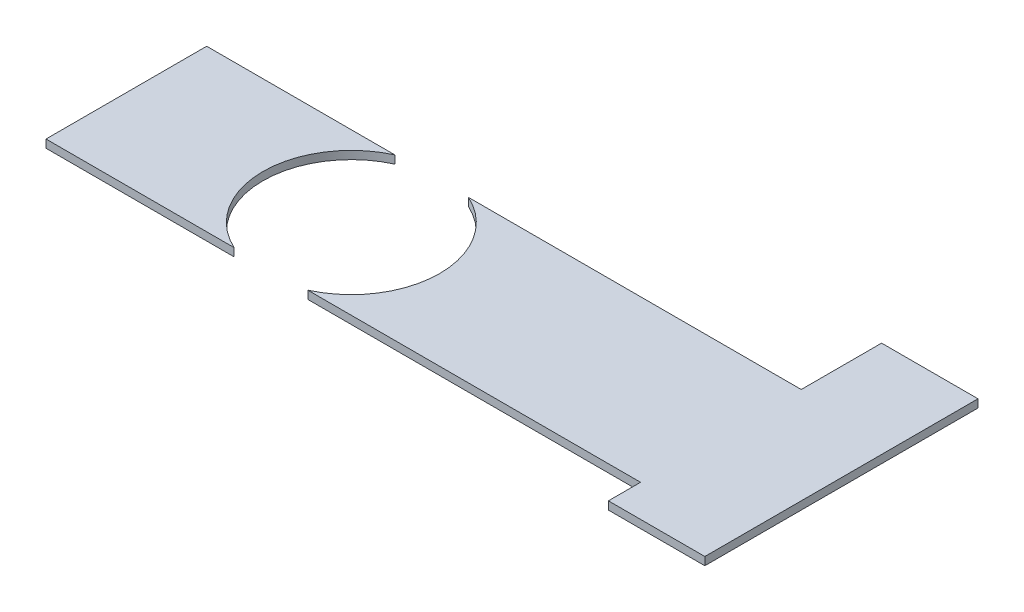
ISO-10303-21;
HEADER;
FILE_DESCRIPTION(('STEP AP214'),'2;1');
FILE_NAME('part.step','',(''),(''),'','','');
FILE_SCHEMA(('AUTOMOTIVE_DESIGN { 1 0 10303 214 1 1 1 1 }'));
ENDSEC;
DATA;
#1=APPLICATION_CONTEXT('core data for automotive mechanical design processes');
#2=APPLICATION_PROTOCOL_DEFINITION('international standard','automotive_design',2000,#1);
#3=PRODUCT_CONTEXT('',#1,'mechanical');
#4=PRODUCT('Part','Part','',(#3));
#5=PRODUCT_RELATED_PRODUCT_CATEGORY('part','',(#4));
#6=PRODUCT_DEFINITION_FORMATION('','',#4);
#7=PRODUCT_DEFINITION_CONTEXT('part definition',#1,'design');
#8=PRODUCT_DEFINITION('design','',#6,#7);
#9=PRODUCT_DEFINITION_SHAPE('','',#8);
#10=(LENGTH_UNIT() NAMED_UNIT(*) SI_UNIT(.MILLI.,.METRE.));
#11=(NAMED_UNIT(*) PLANE_ANGLE_UNIT() SI_UNIT($,.RADIAN.));
#12=(NAMED_UNIT(*) SI_UNIT($,.STERADIAN.) SOLID_ANGLE_UNIT());
#13=UNCERTAINTY_MEASURE_WITH_UNIT(LENGTH_MEASURE(1.E-05),#10,'distance_accuracy_value','');
#14=(GEOMETRIC_REPRESENTATION_CONTEXT(3) GLOBAL_UNCERTAINTY_ASSIGNED_CONTEXT((#13)) GLOBAL_UNIT_ASSIGNED_CONTEXT((#10,
#11,#12)) REPRESENTATION_CONTEXT('',''));
#15=CARTESIAN_POINT('',(0.,0.,0.));
#16=DIRECTION('',(0.,0.,1.));
#17=DIRECTION('',(1.,0.,0.));
#18=AXIS2_PLACEMENT_3D('',#15,#16,#17);
#19=CARTESIAN_POINT('',(25.6779661016949,0.5,5.));
#20=DIRECTION('',(0.,0.,-1.));
#21=DIRECTION('',(-1.,0.,0.));
#22=AXIS2_PLACEMENT_3D('',#19,#20,#21);
#23=PLANE('',#22);
#24=DIRECTION('',(1.,0.,0.));
#25=VECTOR('',#24,1.);
#26=CARTESIAN_POINT('',(25.6779661016949,0.5,5.));
#27=LINE('',#26,#25);
#28=CARTESIAN_POINT('',(4.96925394917282,0.5,5.));
#29=VERTEX_POINT('',#28);
#30=CARTESIAN_POINT('',(25.6779661016949,0.5,5.));
#31=VERTEX_POINT('',#30);
#32=EDGE_CURVE('E116',#29,#31,#27,.T.);
#33=ORIENTED_EDGE('',*,*,#32,.F.);
#34=DIRECTION('',(0.,-1.,0.));
#35=VECTOR('',#34,1.);
#36=CARTESIAN_POINT('',(4.96925394917282,0.5,5.));
#37=LINE('',#36,#35);
#38=CARTESIAN_POINT('',(4.96925394917282,0.,5.));
#39=VERTEX_POINT('',#38);
#40=EDGE_CURVE('E67',#29,#39,#37,.T.);
#41=ORIENTED_EDGE('',*,*,#40,.T.);
#42=DIRECTION('',(1.,0.,0.));
#43=VECTOR('',#42,1.);
#44=CARTESIAN_POINT('',(25.6779661016949,0.,5.));
#45=LINE('',#44,#43);
#46=CARTESIAN_POINT('',(25.6779661016949,0.,5.));
#47=VERTEX_POINT('',#46);
#48=EDGE_CURVE('E132',#39,#47,#45,.T.);
#49=ORIENTED_EDGE('',*,*,#48,.T.);
#50=DIRECTION('',(0.,-1.,0.));
#51=VECTOR('',#50,1.);
#52=CARTESIAN_POINT('',(25.6779661016949,0.5,5.));
#53=LINE('',#52,#51);
#54=EDGE_CURVE('E167',#31,#47,#53,.T.);
#55=ORIENTED_EDGE('',*,*,#54,.F.);
#56=EDGE_LOOP('',(#33,#41,#49,#55));
#57=FACE_BOUND('',#56,.T.);
#58=ADVANCED_FACE('F49',(#57),#23,.F.);
#59=CARTESIAN_POINT('',(0.,0.5,0.));
#60=DIRECTION('',(0.,-1.,0.));
#61=DIRECTION('',(0.,0.,-1.));
#62=AXIS2_PLACEMENT_3D('',#59,#60,#61);
#63=PLANE('',#62);
#64=DIRECTION('',(-1.,0.,0.));
#65=VECTOR('',#64,1.);
#66=CARTESIAN_POINT('',(-11.3220338983051,0.5,-5.));
#67=LINE('',#66,#65);
#68=CARTESIAN_POINT('',(25.6779661016949,0.5,-5.));
#69=VERTEX_POINT('',#68);
#70=CARTESIAN_POINT('',(4.96925394917283,0.5,-5.));
#71=VERTEX_POINT('',#70);
#72=EDGE_CURVE('E117',#69,#71,#67,.T.);
#73=ORIENTED_EDGE('',*,*,#72,.T.);
#74=CARTESIAN_POINT('',(2.6779661016949,0.5,0.));
#75=DIRECTION('',(0.,-1.,0.));
#76=DIRECTION('',(0.,0.,-1.));
#77=AXIS2_PLACEMENT_3D('',#74,#75,#76);
#78=CIRCLE('',#77,5.5);
#79=EDGE_CURVE('E53',#71,#29,#78,.T.);
#80=ORIENTED_EDGE('',*,*,#79,.T.);
#81=ORIENTED_EDGE('',*,*,#32,.T.);
#82=DIRECTION('',(0.,0.,1.));
#83=VECTOR('',#82,1.);
#84=CARTESIAN_POINT('',(25.6779661016949,0.5,7.));
#85=LINE('',#84,#83);
#86=CARTESIAN_POINT('',(25.6779661016949,0.5,7.));
#87=VERTEX_POINT('',#86);
#88=EDGE_CURVE('E138',#31,#87,#85,.T.);
#89=ORIENTED_EDGE('',*,*,#88,.T.);
#90=DIRECTION('',(1.,0.,0.));
#91=VECTOR('',#90,1.);
#92=CARTESIAN_POINT('',(31.6779661016949,0.5,7.));
#93=LINE('',#92,#91);
#94=CARTESIAN_POINT('',(31.6779661016949,0.5,7.));
#95=VERTEX_POINT('',#94);
#96=EDGE_CURVE('E179',#87,#95,#93,.T.);
#97=ORIENTED_EDGE('',*,*,#96,.T.);
#98=DIRECTION('',(0.,0.,-1.));
#99=VECTOR('',#98,1.);
#100=CARTESIAN_POINT('',(31.6779661016949,0.5,-10.));
#101=LINE('',#100,#99);
#102=CARTESIAN_POINT('',(31.6779661016949,0.5,-10.));
#103=VERTEX_POINT('',#102);
#104=EDGE_CURVE('E176',#95,#103,#101,.T.);
#105=ORIENTED_EDGE('',*,*,#104,.T.);
#106=DIRECTION('',(-1.,0.,0.));
#107=VECTOR('',#106,1.);
#108=CARTESIAN_POINT('',(25.6779661016949,0.5,-10.));
#109=LINE('',#108,#107);
#110=CARTESIAN_POINT('',(25.6779661016949,0.5,-10.));
#111=VERTEX_POINT('',#110);
#112=EDGE_CURVE('E173',#103,#111,#109,.T.);
#113=ORIENTED_EDGE('',*,*,#112,.T.);
#114=DIRECTION('',(0.,0.,1.));
#115=VECTOR('',#114,1.);
#116=CARTESIAN_POINT('',(25.6779661016949,0.5,-5.));
#117=LINE('',#116,#115);
#118=EDGE_CURVE('E129',#111,#69,#117,.T.);
#119=ORIENTED_EDGE('',*,*,#118,.T.);
#120=EDGE_LOOP('',(#73,#80,#81,#89,#97,#105,#113,#119));
#121=FACE_BOUND('',#120,.T.);
#122=ADVANCED_FACE('F127',(#121),#63,.F.);
#123=CARTESIAN_POINT('',(0.,0.,0.));
#124=DIRECTION('',(0.,-1.,0.));
#125=DIRECTION('',(0.,0.,-1.));
#126=AXIS2_PLACEMENT_3D('',#123,#124,#125);
#127=PLANE('',#126);
#128=CARTESIAN_POINT('',(2.6779661016949,0.,0.));
#129=DIRECTION('',(0.,-1.,0.));
#130=DIRECTION('',(0.,0.,-1.));
#131=AXIS2_PLACEMENT_3D('',#128,#129,#130);
#132=CIRCLE('',#131,5.5);
#133=CARTESIAN_POINT('',(4.96925394917283,0.,-5.));
#134=VERTEX_POINT('',#133);
#135=EDGE_CURVE('E12',#134,#39,#132,.T.);
#136=ORIENTED_EDGE('',*,*,#135,.F.);
#137=DIRECTION('',(-1.,0.,0.));
#138=VECTOR('',#137,1.);
#139=CARTESIAN_POINT('',(-11.3220338983051,0.,-5.));
#140=LINE('',#139,#138);
#141=CARTESIAN_POINT('',(25.6779661016949,0.,-5.));
#142=VERTEX_POINT('',#141);
#143=EDGE_CURVE('E124',#142,#134,#140,.T.);
#144=ORIENTED_EDGE('',*,*,#143,.F.);
#145=DIRECTION('',(0.,0.,1.));
#146=VECTOR('',#145,1.);
#147=CARTESIAN_POINT('',(25.6779661016949,0.,-5.));
#148=LINE('',#147,#146);
#149=CARTESIAN_POINT('',(25.6779661016949,0.,-10.));
#150=VERTEX_POINT('',#149);
#151=EDGE_CURVE('E143',#150,#142,#148,.T.);
#152=ORIENTED_EDGE('',*,*,#151,.F.);
#153=DIRECTION('',(-1.,0.,0.));
#154=VECTOR('',#153,1.);
#155=CARTESIAN_POINT('',(25.6779661016949,0.,-10.));
#156=LINE('',#155,#154);
#157=CARTESIAN_POINT('',(31.6779661016949,0.,-10.));
#158=VERTEX_POINT('',#157);
#159=EDGE_CURVE('E156',#158,#150,#156,.T.);
#160=ORIENTED_EDGE('',*,*,#159,.F.);
#161=DIRECTION('',(0.,0.,-1.));
#162=VECTOR('',#161,1.);
#163=CARTESIAN_POINT('',(31.6779661016949,0.,-10.));
#164=LINE('',#163,#162);
#165=CARTESIAN_POINT('',(31.6779661016949,0.,7.));
#166=VERTEX_POINT('',#165);
#167=EDGE_CURVE('E160',#166,#158,#164,.T.);
#168=ORIENTED_EDGE('',*,*,#167,.F.);
#169=DIRECTION('',(1.,0.,0.));
#170=VECTOR('',#169,1.);
#171=CARTESIAN_POINT('',(31.6779661016949,0.,7.));
#172=LINE('',#171,#170);
#173=CARTESIAN_POINT('',(25.6779661016949,0.,7.));
#174=VERTEX_POINT('',#173);
#175=EDGE_CURVE('E164',#174,#166,#172,.T.);
#176=ORIENTED_EDGE('',*,*,#175,.F.);
#177=DIRECTION('',(0.,0.,1.));
#178=VECTOR('',#177,1.);
#179=CARTESIAN_POINT('',(25.6779661016949,0.,7.));
#180=LINE('',#179,#178);
#181=EDGE_CURVE('E168',#47,#174,#180,.T.);
#182=ORIENTED_EDGE('',*,*,#181,.F.);
#183=ORIENTED_EDGE('',*,*,#48,.F.);
#184=EDGE_LOOP('',(#136,#144,#152,#160,#168,#176,#182,#183));
#185=FACE_BOUND('',#184,.T.);
#186=ADVANCED_FACE('F191',(#185),#127,.T.);
#187=CARTESIAN_POINT('',(25.6779661016949,0.5,7.));
#188=DIRECTION('',(1.,0.,0.));
#189=DIRECTION('',(0.,0.,-1.));
#190=AXIS2_PLACEMENT_3D('',#187,#188,#189);
#191=PLANE('',#190);
#192=ORIENTED_EDGE('',*,*,#181,.T.);
#193=DIRECTION('',(0.,-1.,0.));
#194=VECTOR('',#193,1.);
#195=CARTESIAN_POINT('',(25.6779661016949,0.5,7.));
#196=LINE('',#195,#194);
#197=EDGE_CURVE('E163',#87,#174,#196,.T.);
#198=ORIENTED_EDGE('',*,*,#197,.F.);
#199=ORIENTED_EDGE('',*,*,#88,.F.);
#200=ORIENTED_EDGE('',*,*,#54,.T.);
#201=EDGE_LOOP('',(#192,#198,#199,#200));
#202=FACE_BOUND('',#201,.T.);
#203=ADVANCED_FACE('F197',(#202),#191,.F.);
#204=CARTESIAN_POINT('',(31.6779661016949,0.5,7.));
#205=DIRECTION('',(0.,0.,-1.));
#206=DIRECTION('',(-1.,0.,0.));
#207=AXIS2_PLACEMENT_3D('',#204,#205,#206);
#208=PLANE('',#207);
#209=ORIENTED_EDGE('',*,*,#175,.T.);
#210=DIRECTION('',(0.,-1.,0.));
#211=VECTOR('',#210,1.);
#212=CARTESIAN_POINT('',(31.6779661016949,0.5,7.));
#213=LINE('',#212,#211);
#214=EDGE_CURVE('E159',#95,#166,#213,.T.);
#215=ORIENTED_EDGE('',*,*,#214,.F.);
#216=ORIENTED_EDGE('',*,*,#96,.F.);
#217=ORIENTED_EDGE('',*,*,#197,.T.);
#218=EDGE_LOOP('',(#209,#215,#216,#217));
#219=FACE_BOUND('',#218,.T.);
#220=ADVANCED_FACE('F201',(#219),#208,.F.);
#221=CARTESIAN_POINT('',(31.6779661016949,0.5,-10.));
#222=DIRECTION('',(-1.,0.,0.));
#223=DIRECTION('',(0.,0.,1.));
#224=AXIS2_PLACEMENT_3D('',#221,#222,#223);
#225=PLANE('',#224);
#226=ORIENTED_EDGE('',*,*,#167,.T.);
#227=DIRECTION('',(0.,-1.,0.));
#228=VECTOR('',#227,1.);
#229=CARTESIAN_POINT('',(31.6779661016949,0.5,-10.));
#230=LINE('',#229,#228);
#231=EDGE_CURVE('E149',#103,#158,#230,.T.);
#232=ORIENTED_EDGE('',*,*,#231,.F.);
#233=ORIENTED_EDGE('',*,*,#104,.F.);
#234=ORIENTED_EDGE('',*,*,#214,.T.);
#235=EDGE_LOOP('',(#226,#232,#233,#234));
#236=FACE_BOUND('',#235,.T.);
#237=ADVANCED_FACE('F210',(#236),#225,.F.);
#238=CARTESIAN_POINT('',(25.6779661016949,0.5,-10.));
#239=DIRECTION('',(0.,0.,1.));
#240=DIRECTION('',(1.,0.,0.));
#241=AXIS2_PLACEMENT_3D('',#238,#239,#240);
#242=PLANE('',#241);
#243=ORIENTED_EDGE('',*,*,#159,.T.);
#244=DIRECTION('',(0.,-1.,0.));
#245=VECTOR('',#244,1.);
#246=CARTESIAN_POINT('',(25.6779661016949,0.5,-10.));
#247=LINE('',#246,#245);
#248=EDGE_CURVE('E140',#111,#150,#247,.T.);
#249=ORIENTED_EDGE('',*,*,#248,.F.);
#250=ORIENTED_EDGE('',*,*,#112,.F.);
#251=ORIENTED_EDGE('',*,*,#231,.T.);
#252=EDGE_LOOP('',(#243,#249,#250,#251));
#253=FACE_BOUND('',#252,.T.);
#254=ADVANCED_FACE('F215',(#253),#242,.F.);
#255=CARTESIAN_POINT('',(25.6779661016949,0.5,-5.));
#256=DIRECTION('',(1.,0.,0.));
#257=DIRECTION('',(0.,0.,-1.));
#258=AXIS2_PLACEMENT_3D('',#255,#256,#257);
#259=PLANE('',#258);
#260=ORIENTED_EDGE('',*,*,#151,.T.);
#261=DIRECTION('',(0.,-1.,0.));
#262=VECTOR('',#261,1.);
#263=CARTESIAN_POINT('',(25.6779661016949,0.5,-5.));
#264=LINE('',#263,#262);
#265=EDGE_CURVE('E60',#69,#142,#264,.T.);
#266=ORIENTED_EDGE('',*,*,#265,.F.);
#267=ORIENTED_EDGE('',*,*,#118,.F.);
#268=ORIENTED_EDGE('',*,*,#248,.T.);
#269=EDGE_LOOP('',(#260,#266,#267,#268));
#270=FACE_BOUND('',#269,.T.);
#271=ADVANCED_FACE('F219',(#270),#259,.F.);
#272=CARTESIAN_POINT('',(-11.3220338983051,0.5,-5.));
#273=DIRECTION('',(0.,0.,1.));
#274=DIRECTION('',(1.,0.,0.));
#275=AXIS2_PLACEMENT_3D('',#272,#273,#274);
#276=PLANE('',#275);
#277=ORIENTED_EDGE('',*,*,#143,.T.);
#278=DIRECTION('',(0.,-1.,0.));
#279=VECTOR('',#278,1.);
#280=CARTESIAN_POINT('',(4.96925394917283,0.5,-5.));
#281=LINE('',#280,#279);
#282=EDGE_CURVE('E110',#134,#71,#281,.F.);
#283=ORIENTED_EDGE('',*,*,#282,.T.);
#284=ORIENTED_EDGE('',*,*,#72,.F.);
#285=ORIENTED_EDGE('',*,*,#265,.T.);
#286=EDGE_LOOP('',(#277,#283,#284,#285));
#287=FACE_BOUND('',#286,.T.);
#288=ADVANCED_FACE('F121',(#287),#276,.F.);
#289=CARTESIAN_POINT('',(2.6779661016949,0.5,0.));
#290=DIRECTION('',(0.,-1.,0.));
#291=DIRECTION('',(0.,0.,-1.));
#292=AXIS2_PLACEMENT_3D('',#289,#290,#291);
#293=CYLINDRICAL_SURFACE('',#292,5.5);
#294=ORIENTED_EDGE('',*,*,#79,.F.);
#295=ORIENTED_EDGE('',*,*,#282,.F.);
#296=ORIENTED_EDGE('',*,*,#135,.T.);
#297=ORIENTED_EDGE('',*,*,#40,.F.);
#298=EDGE_LOOP('',(#294,#295,#296,#297));
#299=FACE_BOUND('',#298,.T.);
#300=ADVANCED_FACE('F51',(#299),#293,.F.);
#301=CLOSED_SHELL('',(#58,#122,#186,#203,#220,#237,#254,#271,#288,#300));
#302=MANIFOLD_SOLID_BREP('B2',#301);
#303=CARTESIAN_POINT('',(-11.3220338983051,0.5,5.));
#304=DIRECTION('',(1.,0.,0.));
#305=DIRECTION('',(0.,0.,-1.));
#306=AXIS2_PLACEMENT_3D('',#303,#304,#305);
#307=PLANE('',#306);
#308=DIRECTION('',(0.,0.,1.));
#309=VECTOR('',#308,1.);
#310=CARTESIAN_POINT('',(-11.3220338983051,0.,5.));
#311=LINE('',#310,#309);
#312=CARTESIAN_POINT('',(-11.3220338983051,0.,-5.));
#313=VERTEX_POINT('',#312);
#314=CARTESIAN_POINT('',(-11.3220338983051,0.,5.));
#315=VERTEX_POINT('',#314);
#316=EDGE_CURVE('E352',#313,#315,#311,.T.);
#317=ORIENTED_EDGE('',*,*,#316,.T.);
#318=DIRECTION('',(0.,-1.,0.));
#319=VECTOR('',#318,1.);
#320=CARTESIAN_POINT('',(-11.3220338983051,0.5,5.));
#321=LINE('',#320,#319);
#322=CARTESIAN_POINT('',(-11.3220338983051,0.5,5.));
#323=VERTEX_POINT('',#322);
#324=EDGE_CURVE('E308',#323,#315,#321,.T.);
#325=ORIENTED_EDGE('',*,*,#324,.F.);
#326=DIRECTION('',(0.,0.,1.));
#327=VECTOR('',#326,1.);
#328=CARTESIAN_POINT('',(-11.3220338983051,0.5,5.));
#329=LINE('',#328,#327);
#330=CARTESIAN_POINT('',(-11.3220338983051,0.5,-5.));
#331=VERTEX_POINT('',#330);
#332=EDGE_CURVE('E346',#331,#323,#329,.T.);
#333=ORIENTED_EDGE('',*,*,#332,.F.);
#334=DIRECTION('',(0.,-1.,0.));
#335=VECTOR('',#334,1.);
#336=CARTESIAN_POINT('',(-11.3220338983051,0.5,-5.));
#337=LINE('',#336,#335);
#338=EDGE_CURVE('E340',#331,#313,#337,.T.);
#339=ORIENTED_EDGE('',*,*,#338,.T.);
#340=EDGE_LOOP('',(#317,#325,#333,#339));
#341=FACE_BOUND('',#340,.T.);
#342=ADVANCED_FACE('F301',(#341),#307,.F.);
#343=CARTESIAN_POINT('',(0.,0.,0.));
#344=DIRECTION('',(0.,-1.,0.));
#345=DIRECTION('',(0.,0.,-1.));
#346=AXIS2_PLACEMENT_3D('',#343,#344,#345);
#347=PLANE('',#346);
#348=CARTESIAN_POINT('',(2.6779661016949,0.,0.));
#349=DIRECTION('',(0.,-1.,0.));
#350=DIRECTION('',(0.,0.,-1.));
#351=AXIS2_PLACEMENT_3D('',#348,#349,#350);
#352=CIRCLE('',#351,5.5);
#353=CARTESIAN_POINT('',(0.386678254216982,0.,5.));
#354=VERTEX_POINT('',#353);
#355=CARTESIAN_POINT('',(0.386678254216978,0.,-5.));
#356=VERTEX_POINT('',#355);
#357=EDGE_CURVE('E47',#354,#356,#352,.T.);
#358=ORIENTED_EDGE('',*,*,#357,.F.);
#359=DIRECTION('',(1.,0.,0.));
#360=VECTOR('',#359,1.);
#361=CARTESIAN_POINT('',(25.6779661016949,0.,5.));
#362=LINE('',#361,#360);
#363=EDGE_CURVE('E347',#315,#354,#362,.T.);
#364=ORIENTED_EDGE('',*,*,#363,.F.);
#365=ORIENTED_EDGE('',*,*,#316,.F.);
#366=DIRECTION('',(-1.,0.,0.));
#367=VECTOR('',#366,1.);
#368=CARTESIAN_POINT('',(-11.3220338983051,0.,-5.));
#369=LINE('',#368,#367);
#370=EDGE_CURVE('E337',#356,#313,#369,.T.);
#371=ORIENTED_EDGE('',*,*,#370,.F.);
#372=EDGE_LOOP('',(#358,#364,#365,#371));
#373=FACE_BOUND('',#372,.T.);
#374=ADVANCED_FACE('F354',(#373),#347,.T.);
#375=CARTESIAN_POINT('',(0.,0.5,0.));
#376=DIRECTION('',(0.,-1.,0.));
#377=DIRECTION('',(0.,0.,-1.));
#378=AXIS2_PLACEMENT_3D('',#375,#376,#377);
#379=PLANE('',#378);
#380=DIRECTION('',(1.,0.,0.));
#381=VECTOR('',#380,1.);
#382=CARTESIAN_POINT('',(25.6779661016949,0.5,5.));
#383=LINE('',#382,#381);
#384=CARTESIAN_POINT('',(0.386678254216982,0.5,5.));
#385=VERTEX_POINT('',#384);
#386=EDGE_CURVE('E365',#323,#385,#383,.T.);
#387=ORIENTED_EDGE('',*,*,#386,.T.);
#388=CARTESIAN_POINT('',(2.6779661016949,0.5,0.));
#389=DIRECTION('',(0.,-1.,0.));
#390=DIRECTION('',(0.,0.,-1.));
#391=AXIS2_PLACEMENT_3D('',#388,#389,#390);
#392=CIRCLE('',#391,5.5);
#393=CARTESIAN_POINT('',(0.386678254216978,0.5,-5.));
#394=VERTEX_POINT('',#393);
#395=EDGE_CURVE('E371',#385,#394,#392,.T.);
#396=ORIENTED_EDGE('',*,*,#395,.T.);
#397=DIRECTION('',(-1.,0.,0.));
#398=VECTOR('',#397,1.);
#399=CARTESIAN_POINT('',(-11.3220338983051,0.5,-5.));
#400=LINE('',#399,#398);
#401=EDGE_CURVE('E323',#394,#331,#400,.T.);
#402=ORIENTED_EDGE('',*,*,#401,.T.);
#403=ORIENTED_EDGE('',*,*,#332,.T.);
#404=EDGE_LOOP('',(#387,#396,#402,#403));
#405=FACE_BOUND('',#404,.T.);
#406=ADVANCED_FACE('F367',(#405),#379,.F.);
#407=CARTESIAN_POINT('',(-11.3220338983051,0.5,-5.));
#408=DIRECTION('',(0.,0.,1.));
#409=DIRECTION('',(1.,0.,0.));
#410=AXIS2_PLACEMENT_3D('',#407,#408,#409);
#411=PLANE('',#410);
#412=ORIENTED_EDGE('',*,*,#401,.F.);
#413=DIRECTION('',(0.,-1.,0.));
#414=VECTOR('',#413,1.);
#415=CARTESIAN_POINT('',(0.386678254216978,0.5,-5.));
#416=LINE('',#415,#414);
#417=EDGE_CURVE('E343',#394,#356,#416,.T.);
#418=ORIENTED_EDGE('',*,*,#417,.T.);
#419=ORIENTED_EDGE('',*,*,#370,.T.);
#420=ORIENTED_EDGE('',*,*,#338,.F.);
#421=EDGE_LOOP('',(#412,#418,#419,#420));
#422=FACE_BOUND('',#421,.T.);
#423=ADVANCED_FACE('F339',(#422),#411,.F.);
#424=CARTESIAN_POINT('',(25.6779661016949,0.5,5.));
#425=DIRECTION('',(0.,0.,-1.));
#426=DIRECTION('',(-1.,0.,0.));
#427=AXIS2_PLACEMENT_3D('',#424,#425,#426);
#428=PLANE('',#427);
#429=ORIENTED_EDGE('',*,*,#363,.T.);
#430=DIRECTION('',(0.,-1.,0.));
#431=VECTOR('',#430,1.);
#432=CARTESIAN_POINT('',(0.386678254216982,0.5,5.));
#433=LINE('',#432,#431);
#434=EDGE_CURVE('E314',#354,#385,#433,.F.);
#435=ORIENTED_EDGE('',*,*,#434,.T.);
#436=ORIENTED_EDGE('',*,*,#386,.F.);
#437=ORIENTED_EDGE('',*,*,#324,.T.);
#438=EDGE_LOOP('',(#429,#435,#436,#437));
#439=FACE_BOUND('',#438,.T.);
#440=ADVANCED_FACE('F363',(#439),#428,.F.);
#441=CARTESIAN_POINT('',(2.6779661016949,0.5,0.));
#442=DIRECTION('',(0.,-1.,0.));
#443=DIRECTION('',(0.,0.,-1.));
#444=AXIS2_PLACEMENT_3D('',#441,#442,#443);
#445=CYLINDRICAL_SURFACE('',#444,5.5);
#446=ORIENTED_EDGE('',*,*,#357,.T.);
#447=ORIENTED_EDGE('',*,*,#417,.F.);
#448=ORIENTED_EDGE('',*,*,#395,.F.);
#449=ORIENTED_EDGE('',*,*,#434,.F.);
#450=EDGE_LOOP('',(#446,#447,#448,#449));
#451=FACE_BOUND('',#450,.T.);
#452=ADVANCED_FACE('F374',(#451),#445,.F.);
#453=CLOSED_SHELL('',(#342,#374,#406,#423,#440,#452));
#454=MANIFOLD_SOLID_BREP('B6',#453);
#455=ADVANCED_BREP_SHAPE_REPRESENTATION('',(#18,#302,#454),#14);
#456=SHAPE_DEFINITION_REPRESENTATION(#9,#455);
ENDSEC;
END-ISO-10303-21;
